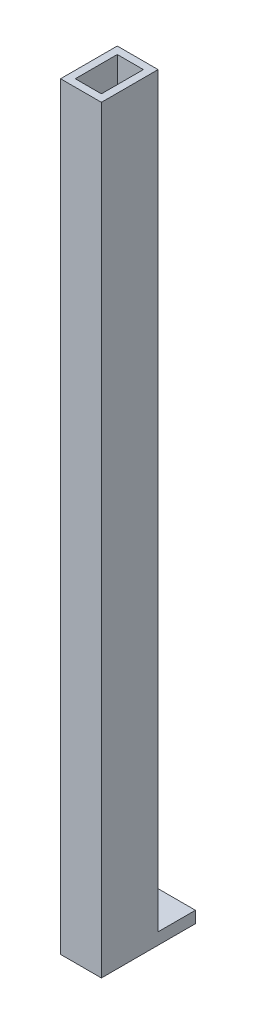
ISO-10303-21;
HEADER;
FILE_DESCRIPTION(('STEP AP214'),'2;1');
FILE_NAME('part.step','',(''),(''),'','','');
FILE_SCHEMA(('AUTOMOTIVE_DESIGN { 1 0 10303 214 1 1 1 1 }'));
ENDSEC;
DATA;
#1=APPLICATION_CONTEXT('core data for automotive mechanical design processes');
#2=APPLICATION_PROTOCOL_DEFINITION('international standard','automotive_design',2000,#1);
#3=PRODUCT_CONTEXT('',#1,'mechanical');
#4=PRODUCT('Part','Part','',(#3));
#5=PRODUCT_RELATED_PRODUCT_CATEGORY('part','',(#4));
#6=PRODUCT_DEFINITION_FORMATION('','',#4);
#7=PRODUCT_DEFINITION_CONTEXT('part definition',#1,'design');
#8=PRODUCT_DEFINITION('design','',#6,#7);
#9=PRODUCT_DEFINITION_SHAPE('','',#8);
#10=(LENGTH_UNIT() NAMED_UNIT(*) SI_UNIT(.MILLI.,.METRE.));
#11=(NAMED_UNIT(*) PLANE_ANGLE_UNIT() SI_UNIT($,.RADIAN.));
#12=(NAMED_UNIT(*) SI_UNIT($,.STERADIAN.) SOLID_ANGLE_UNIT());
#13=UNCERTAINTY_MEASURE_WITH_UNIT(LENGTH_MEASURE(1.E-05),#10,'distance_accuracy_value','');
#14=(GEOMETRIC_REPRESENTATION_CONTEXT(3) GLOBAL_UNCERTAINTY_ASSIGNED_CONTEXT((#13)) GLOBAL_UNIT_ASSIGNED_CONTEXT((#10,
#11,#12)) REPRESENTATION_CONTEXT('',''));
#15=CARTESIAN_POINT('',(0.,0.,0.));
#16=DIRECTION('',(0.,0.,1.));
#17=DIRECTION('',(1.,0.,0.));
#18=AXIS2_PLACEMENT_3D('',#15,#16,#17);
#19=CARTESIAN_POINT('',(0.,203.2,0.));
#20=DIRECTION('',(0.,-1.,0.));
#21=DIRECTION('',(0.,0.,-1.));
#22=AXIS2_PLACEMENT_3D('',#19,#20,#21);
#23=PLANE('',#22);
#24=DIRECTION('',(0.,0.,1.));
#25=VECTOR('',#24,1.);
#26=CARTESIAN_POINT('',(0.,203.2,0.));
#27=LINE('',#26,#25);
#28=CARTESIAN_POINT('',(0.,203.2,-15.43));
#29=VERTEX_POINT('',#28);
#30=CARTESIAN_POINT('',(0.,203.2,0.));
#31=VERTEX_POINT('',#30);
#32=EDGE_CURVE('E99',#29,#31,#27,.T.);
#33=ORIENTED_EDGE('',*,*,#32,.T.);
#34=DIRECTION('',(1.,0.,0.));
#35=VECTOR('',#34,1.);
#36=CARTESIAN_POINT('',(0.,203.2,0.));
#37=LINE('',#36,#35);
#38=CARTESIAN_POINT('',(11.112,203.2,0.));
#39=VERTEX_POINT('',#38);
#40=EDGE_CURVE('E92',#31,#39,#37,.T.);
#41=ORIENTED_EDGE('',*,*,#40,.T.);
#42=DIRECTION('',(0.,0.,-1.));
#43=VECTOR('',#42,1.);
#44=CARTESIAN_POINT('',(11.112,203.2,0.));
#45=LINE('',#44,#43);
#46=CARTESIAN_POINT('',(11.112,203.2,-15.43));
#47=VERTEX_POINT('',#46);
#48=EDGE_CURVE('E96',#39,#47,#45,.T.);
#49=ORIENTED_EDGE('',*,*,#48,.T.);
#50=DIRECTION('',(-1.,0.,0.));
#51=VECTOR('',#50,1.);
#52=CARTESIAN_POINT('',(0.,203.2,-15.43));
#53=LINE('',#52,#51);
#54=EDGE_CURVE('E64',#47,#29,#53,.T.);
#55=ORIENTED_EDGE('',*,*,#54,.T.);
#56=EDGE_LOOP('',(#33,#41,#49,#55));
#57=FACE_BOUND('',#56,.T.);
#58=DIRECTION('',(0.,0.,1.));
#59=VECTOR('',#58,1.);
#60=CARTESIAN_POINT('',(2.,203.2,-2.));
#61=LINE('',#60,#59);
#62=CARTESIAN_POINT('',(2.,203.2,-13.43));
#63=VERTEX_POINT('',#62);
#64=CARTESIAN_POINT('',(2.,203.2,-2.));
#65=VERTEX_POINT('',#64);
#66=EDGE_CURVE('E221',#63,#65,#61,.T.);
#67=ORIENTED_EDGE('',*,*,#66,.F.);
#68=DIRECTION('',(-1.,0.,0.));
#69=VECTOR('',#68,1.);
#70=CARTESIAN_POINT('',(2.,203.2,-13.43));
#71=LINE('',#70,#69);
#72=CARTESIAN_POINT('',(9.112,203.2,-13.43));
#73=VERTEX_POINT('',#72);
#74=EDGE_CURVE('E85',#73,#63,#71,.T.);
#75=ORIENTED_EDGE('',*,*,#74,.F.);
#76=DIRECTION('',(0.,0.,-1.));
#77=VECTOR('',#76,1.);
#78=CARTESIAN_POINT('',(9.112,203.2,-2.));
#79=LINE('',#78,#77);
#80=CARTESIAN_POINT('',(9.112,203.2,-2.));
#81=VERTEX_POINT('',#80);
#82=EDGE_CURVE('E227',#81,#73,#79,.T.);
#83=ORIENTED_EDGE('',*,*,#82,.F.);
#84=DIRECTION('',(1.,0.,0.));
#85=VECTOR('',#84,1.);
#86=CARTESIAN_POINT('',(2.,203.2,-2.));
#87=LINE('',#86,#85);
#88=EDGE_CURVE('E224',#65,#81,#87,.T.);
#89=ORIENTED_EDGE('',*,*,#88,.F.);
#90=EDGE_LOOP('',(#67,#75,#83,#89));
#91=FACE_BOUND('',#90,.T.);
#92=ADVANCED_FACE('F39',(#57,#91),#23,.F.);
#93=CARTESIAN_POINT('',(0.,203.2,0.));
#94=DIRECTION('',(1.,0.,0.));
#95=DIRECTION('',(0.,0.,-1.));
#96=AXIS2_PLACEMENT_3D('',#93,#94,#95);
#97=PLANE('',#96);
#98=DIRECTION('',(0.,-1.,0.));
#99=VECTOR('',#98,1.);
#100=CARTESIAN_POINT('',(0.,203.2,-15.43));
#101=LINE('',#100,#99);
#102=CARTESIAN_POINT('',(0.,0.,-15.43));
#103=VERTEX_POINT('',#102);
#104=EDGE_CURVE('E121',#29,#103,#101,.T.);
#105=ORIENTED_EDGE('',*,*,#104,.T.);
#106=DIRECTION('',(0.,0.,-1.));
#107=VECTOR('',#106,1.);
#108=CARTESIAN_POINT('',(0.,0.,0.));
#109=LINE('',#108,#107);
#110=CARTESIAN_POINT('',(0.,0.,-25.59));
#111=VERTEX_POINT('',#110);
#112=EDGE_CURVE('E77',#103,#111,#109,.T.);
#113=ORIENTED_EDGE('',*,*,#112,.T.);
#114=DIRECTION('',(0.,1.,0.));
#115=VECTOR('',#114,1.);
#116=CARTESIAN_POINT('',(0.,-3.175,-25.59));
#117=LINE('',#116,#115);
#118=CARTESIAN_POINT('',(0.,-3.175,-25.59));
#119=VERTEX_POINT('',#118);
#120=EDGE_CURVE('E217',#119,#111,#117,.T.);
#121=ORIENTED_EDGE('',*,*,#120,.F.);
#122=DIRECTION('',(0.,0.,-1.));
#123=VECTOR('',#122,1.);
#124=CARTESIAN_POINT('',(0.,-3.175,0.));
#125=LINE('',#124,#123);
#126=CARTESIAN_POINT('',(0.,-3.175,0.));
#127=VERTEX_POINT('',#126);
#128=EDGE_CURVE('E193',#127,#119,#125,.T.);
#129=ORIENTED_EDGE('',*,*,#128,.F.);
#130=DIRECTION('',(0.,-1.,0.));
#131=VECTOR('',#130,1.);
#132=CARTESIAN_POINT('',(0.,203.2,0.));
#133=LINE('',#132,#131);
#134=EDGE_CURVE('E11',#31,#127,#133,.T.);
#135=ORIENTED_EDGE('',*,*,#134,.F.);
#136=ORIENTED_EDGE('',*,*,#32,.F.);
#137=EDGE_LOOP('',(#105,#113,#121,#129,#135,#136));
#138=FACE_BOUND('',#137,.T.);
#139=ADVANCED_FACE('F41',(#138),#97,.F.);
#140=CARTESIAN_POINT('',(0.,203.2,0.));
#141=DIRECTION('',(0.,0.,-1.));
#142=DIRECTION('',(-1.,0.,0.));
#143=AXIS2_PLACEMENT_3D('',#140,#141,#142);
#144=PLANE('',#143);
#145=ORIENTED_EDGE('',*,*,#134,.T.);
#146=DIRECTION('',(-1.,0.,0.));
#147=VECTOR('',#146,1.);
#148=CARTESIAN_POINT('',(0.,-3.175,0.));
#149=LINE('',#148,#147);
#150=CARTESIAN_POINT('',(11.112,-3.175,0.));
#151=VERTEX_POINT('',#150);
#152=EDGE_CURVE('E109',#151,#127,#149,.T.);
#153=ORIENTED_EDGE('',*,*,#152,.F.);
#154=DIRECTION('',(0.,-1.,0.));
#155=VECTOR('',#154,1.);
#156=CARTESIAN_POINT('',(11.112,203.2,0.));
#157=LINE('',#156,#155);
#158=EDGE_CURVE('E48',#39,#151,#157,.T.);
#159=ORIENTED_EDGE('',*,*,#158,.F.);
#160=ORIENTED_EDGE('',*,*,#40,.F.);
#161=EDGE_LOOP('',(#145,#153,#159,#160));
#162=FACE_BOUND('',#161,.T.);
#163=ADVANCED_FACE('F106',(#162),#144,.F.);
#164=CARTESIAN_POINT('',(11.112,203.2,0.));
#165=DIRECTION('',(-1.,0.,0.));
#166=DIRECTION('',(0.,0.,1.));
#167=AXIS2_PLACEMENT_3D('',#164,#165,#166);
#168=PLANE('',#167);
#169=ORIENTED_EDGE('',*,*,#158,.T.);
#170=DIRECTION('',(0.,0.,1.));
#171=VECTOR('',#170,1.);
#172=CARTESIAN_POINT('',(11.112,-3.175,0.));
#173=LINE('',#172,#171);
#174=CARTESIAN_POINT('',(11.112,-3.175,-25.59));
#175=VERTEX_POINT('',#174);
#176=EDGE_CURVE('E201',#175,#151,#173,.T.);
#177=ORIENTED_EDGE('',*,*,#176,.F.);
#178=DIRECTION('',(0.,1.,0.));
#179=VECTOR('',#178,1.);
#180=CARTESIAN_POINT('',(11.112,-3.175,-25.59));
#181=LINE('',#180,#179);
#182=CARTESIAN_POINT('',(11.112,0.,-25.59));
#183=VERTEX_POINT('',#182);
#184=EDGE_CURVE('E206',#175,#183,#181,.T.);
#185=ORIENTED_EDGE('',*,*,#184,.T.);
#186=DIRECTION('',(0.,0.,1.));
#187=VECTOR('',#186,1.);
#188=CARTESIAN_POINT('',(11.112,0.,0.));
#189=LINE('',#188,#187);
#190=CARTESIAN_POINT('',(11.112,0.,-15.43));
#191=VERTEX_POINT('',#190);
#192=EDGE_CURVE('E198',#183,#191,#189,.T.);
#193=ORIENTED_EDGE('',*,*,#192,.T.);
#194=DIRECTION('',(0.,-1.,0.));
#195=VECTOR('',#194,1.);
#196=CARTESIAN_POINT('',(11.112,203.2,-15.43));
#197=LINE('',#196,#195);
#198=EDGE_CURVE('E114',#47,#191,#197,.T.);
#199=ORIENTED_EDGE('',*,*,#198,.F.);
#200=ORIENTED_EDGE('',*,*,#48,.F.);
#201=EDGE_LOOP('',(#169,#177,#185,#193,#199,#200));
#202=FACE_BOUND('',#201,.T.);
#203=ADVANCED_FACE('F115',(#202),#168,.F.);
#204=CARTESIAN_POINT('',(0.,203.2,-15.43));
#205=DIRECTION('',(0.,0.,1.));
#206=DIRECTION('',(1.,0.,0.));
#207=AXIS2_PLACEMENT_3D('',#204,#205,#206);
#208=PLANE('',#207);
#209=DIRECTION('',(-1.,0.,0.));
#210=VECTOR('',#209,1.);
#211=CARTESIAN_POINT('',(0.,0.,-15.43));
#212=LINE('',#211,#210);
#213=EDGE_CURVE('E125',#191,#103,#212,.T.);
#214=ORIENTED_EDGE('',*,*,#213,.T.);
#215=ORIENTED_EDGE('',*,*,#104,.F.);
#216=ORIENTED_EDGE('',*,*,#54,.F.);
#217=ORIENTED_EDGE('',*,*,#198,.T.);
#218=EDGE_LOOP('',(#214,#215,#216,#217));
#219=FACE_BOUND('',#218,.T.);
#220=ADVANCED_FACE('F135',(#219),#208,.F.);
#221=CARTESIAN_POINT('',(2.,203.2,-2.));
#222=DIRECTION('',(1.,0.,0.));
#223=DIRECTION('',(0.,0.,-1.));
#224=AXIS2_PLACEMENT_3D('',#221,#222,#223);
#225=PLANE('',#224);
#226=DIRECTION('',(0.,-1.,0.));
#227=VECTOR('',#226,1.);
#228=CARTESIAN_POINT('',(2.,203.2,-2.));
#229=LINE('',#228,#227);
#230=CARTESIAN_POINT('',(2.,-3.175,-2.));
#231=VERTEX_POINT('',#230);
#232=EDGE_CURVE('E128',#65,#231,#229,.T.);
#233=ORIENTED_EDGE('',*,*,#232,.T.);
#234=DIRECTION('',(0.,0.,-1.));
#235=VECTOR('',#234,1.);
#236=CARTESIAN_POINT('',(2.,-3.175,-2.));
#237=LINE('',#236,#235);
#238=CARTESIAN_POINT('',(2.,-3.175,-13.43));
#239=VERTEX_POINT('',#238);
#240=EDGE_CURVE('E174',#231,#239,#237,.T.);
#241=ORIENTED_EDGE('',*,*,#240,.T.);
#242=DIRECTION('',(0.,-1.,0.));
#243=VECTOR('',#242,1.);
#244=CARTESIAN_POINT('',(2.,203.2,-13.43));
#245=LINE('',#244,#243);
#246=EDGE_CURVE('E163',#63,#239,#245,.T.);
#247=ORIENTED_EDGE('',*,*,#246,.F.);
#248=ORIENTED_EDGE('',*,*,#66,.T.);
#249=EDGE_LOOP('',(#233,#241,#247,#248));
#250=FACE_BOUND('',#249,.T.);
#251=ADVANCED_FACE('F175',(#250),#225,.T.);
#252=CARTESIAN_POINT('',(2.,203.2,-2.));
#253=DIRECTION('',(0.,0.,-1.));
#254=DIRECTION('',(-1.,0.,0.));
#255=AXIS2_PLACEMENT_3D('',#252,#253,#254);
#256=PLANE('',#255);
#257=DIRECTION('',(0.,-1.,0.));
#258=VECTOR('',#257,1.);
#259=CARTESIAN_POINT('',(9.112,203.2,-2.));
#260=LINE('',#259,#258);
#261=CARTESIAN_POINT('',(9.112,-3.175,-2.));
#262=VERTEX_POINT('',#261);
#263=EDGE_CURVE('E234',#81,#262,#260,.T.);
#264=ORIENTED_EDGE('',*,*,#263,.T.);
#265=DIRECTION('',(-1.,0.,0.));
#266=VECTOR('',#265,1.);
#267=CARTESIAN_POINT('',(2.,-3.175,-2.));
#268=LINE('',#267,#266);
#269=EDGE_CURVE('E188',#262,#231,#268,.T.);
#270=ORIENTED_EDGE('',*,*,#269,.T.);
#271=ORIENTED_EDGE('',*,*,#232,.F.);
#272=ORIENTED_EDGE('',*,*,#88,.T.);
#273=EDGE_LOOP('',(#264,#270,#271,#272));
#274=FACE_BOUND('',#273,.T.);
#275=ADVANCED_FACE('F241',(#274),#256,.T.);
#276=CARTESIAN_POINT('',(9.112,203.2,-2.));
#277=DIRECTION('',(-1.,0.,0.));
#278=DIRECTION('',(0.,0.,1.));
#279=AXIS2_PLACEMENT_3D('',#276,#277,#278);
#280=PLANE('',#279);
#281=DIRECTION('',(0.,-1.,0.));
#282=VECTOR('',#281,1.);
#283=CARTESIAN_POINT('',(9.112,203.2,-13.43));
#284=LINE('',#283,#282);
#285=CARTESIAN_POINT('',(9.112,-3.175,-13.43));
#286=VERTEX_POINT('',#285);
#287=EDGE_CURVE('E55',#73,#286,#284,.T.);
#288=ORIENTED_EDGE('',*,*,#287,.T.);
#289=DIRECTION('',(0.,0.,1.));
#290=VECTOR('',#289,1.);
#291=CARTESIAN_POINT('',(9.112,-3.175,-2.));
#292=LINE('',#291,#290);
#293=EDGE_CURVE('E184',#286,#262,#292,.T.);
#294=ORIENTED_EDGE('',*,*,#293,.T.);
#295=ORIENTED_EDGE('',*,*,#263,.F.);
#296=ORIENTED_EDGE('',*,*,#82,.T.);
#297=EDGE_LOOP('',(#288,#294,#295,#296));
#298=FACE_BOUND('',#297,.T.);
#299=ADVANCED_FACE('F245',(#298),#280,.T.);
#300=CARTESIAN_POINT('',(2.,203.2,-13.43));
#301=DIRECTION('',(0.,0.,1.));
#302=DIRECTION('',(1.,0.,0.));
#303=AXIS2_PLACEMENT_3D('',#300,#301,#302);
#304=PLANE('',#303);
#305=ORIENTED_EDGE('',*,*,#246,.T.);
#306=DIRECTION('',(1.,0.,0.));
#307=VECTOR('',#306,1.);
#308=CARTESIAN_POINT('',(2.,-3.175,-13.43));
#309=LINE('',#308,#307);
#310=EDGE_CURVE('E167',#239,#286,#309,.T.);
#311=ORIENTED_EDGE('',*,*,#310,.T.);
#312=ORIENTED_EDGE('',*,*,#287,.F.);
#313=ORIENTED_EDGE('',*,*,#74,.T.);
#314=EDGE_LOOP('',(#305,#311,#312,#313));
#315=FACE_BOUND('',#314,.T.);
#316=ADVANCED_FACE('F165',(#315),#304,.T.);
#317=CARTESIAN_POINT('',(0.,-3.175,0.));
#318=DIRECTION('',(0.,-1.,0.));
#319=DIRECTION('',(0.,0.,-1.));
#320=AXIS2_PLACEMENT_3D('',#317,#318,#319);
#321=PLANE('',#320);
#322=ORIENTED_EDGE('',*,*,#128,.T.);
#323=DIRECTION('',(1.,0.,0.));
#324=VECTOR('',#323,1.);
#325=CARTESIAN_POINT('',(0.,-3.175,-25.59));
#326=LINE('',#325,#324);
#327=EDGE_CURVE('E197',#119,#175,#326,.T.);
#328=ORIENTED_EDGE('',*,*,#327,.T.);
#329=ORIENTED_EDGE('',*,*,#176,.T.);
#330=ORIENTED_EDGE('',*,*,#152,.T.);
#331=EDGE_LOOP('',(#322,#328,#329,#330));
#332=FACE_BOUND('',#331,.T.);
#333=ORIENTED_EDGE('',*,*,#310,.F.);
#334=ORIENTED_EDGE('',*,*,#240,.F.);
#335=ORIENTED_EDGE('',*,*,#269,.F.);
#336=ORIENTED_EDGE('',*,*,#293,.F.);
#337=EDGE_LOOP('',(#333,#334,#335,#336));
#338=FACE_BOUND('',#337,.T.);
#339=ADVANCED_FACE('F182',(#332,#338),#321,.T.);
#340=CARTESIAN_POINT('',(0.,0.,0.));
#341=DIRECTION('',(0.,-1.,0.));
#342=DIRECTION('',(0.,0.,-1.));
#343=AXIS2_PLACEMENT_3D('',#340,#341,#342);
#344=PLANE('',#343);
#345=ORIENTED_EDGE('',*,*,#213,.F.);
#346=ORIENTED_EDGE('',*,*,#192,.F.);
#347=DIRECTION('',(1.,0.,0.));
#348=VECTOR('',#347,1.);
#349=CARTESIAN_POINT('',(0.,0.,-25.59));
#350=LINE('',#349,#348);
#351=EDGE_CURVE('E209',#111,#183,#350,.T.);
#352=ORIENTED_EDGE('',*,*,#351,.F.);
#353=ORIENTED_EDGE('',*,*,#112,.F.);
#354=EDGE_LOOP('',(#345,#346,#352,#353));
#355=FACE_BOUND('',#354,.T.);
#356=ADVANCED_FACE('F299',(#355),#344,.F.);
#357=CARTESIAN_POINT('',(0.,-3.175,-25.59));
#358=DIRECTION('',(0.,0.,1.));
#359=DIRECTION('',(1.,0.,0.));
#360=AXIS2_PLACEMENT_3D('',#357,#358,#359);
#361=PLANE('',#360);
#362=ORIENTED_EDGE('',*,*,#351,.T.);
#363=ORIENTED_EDGE('',*,*,#184,.F.);
#364=ORIENTED_EDGE('',*,*,#327,.F.);
#365=ORIENTED_EDGE('',*,*,#120,.T.);
#366=EDGE_LOOP('',(#362,#363,#364,#365));
#367=FACE_BOUND('',#366,.T.);
#368=ADVANCED_FACE('F307',(#367),#361,.F.);
#369=CLOSED_SHELL('',(#92,#139,#163,#203,#220,#251,#275,#299,#316,#339,#356,#368));
#370=MANIFOLD_SOLID_BREP('B2',#369);
#371=ADVANCED_BREP_SHAPE_REPRESENTATION('',(#18,#370),#14);
#372=SHAPE_DEFINITION_REPRESENTATION(#9,#371);
ENDSEC;
END-ISO-10303-21;
